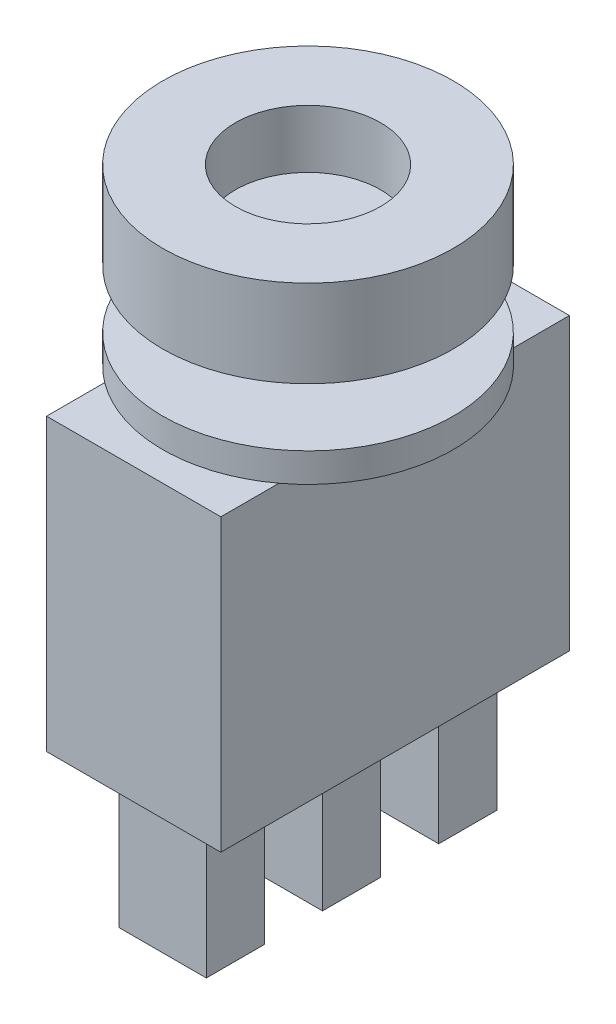
ISO-10303-21;
HEADER;
FILE_DESCRIPTION(('STEP AP214'),'2;1');
FILE_NAME('part.step','',(''),(''),'','','');
FILE_SCHEMA(('AUTOMOTIVE_DESIGN { 1 0 10303 214 1 1 1 1 }'));
ENDSEC;
DATA;
#1=APPLICATION_CONTEXT('core data for automotive mechanical design processes');
#2=APPLICATION_PROTOCOL_DEFINITION('international standard','automotive_design',2000,#1);
#3=PRODUCT_CONTEXT('',#1,'mechanical');
#4=PRODUCT('Part','Part','',(#3));
#5=PRODUCT_RELATED_PRODUCT_CATEGORY('part','',(#4));
#6=PRODUCT_DEFINITION_FORMATION('','',#4);
#7=PRODUCT_DEFINITION_CONTEXT('part definition',#1,'design');
#8=PRODUCT_DEFINITION('design','',#6,#7);
#9=PRODUCT_DEFINITION_SHAPE('','',#8);
#10=(LENGTH_UNIT() NAMED_UNIT(*) SI_UNIT(.MILLI.,.METRE.));
#11=(NAMED_UNIT(*) PLANE_ANGLE_UNIT() SI_UNIT($,.RADIAN.));
#12=(NAMED_UNIT(*) SI_UNIT($,.STERADIAN.) SOLID_ANGLE_UNIT());
#13=UNCERTAINTY_MEASURE_WITH_UNIT(LENGTH_MEASURE(1.E-05),#10,'distance_accuracy_value','');
#14=(GEOMETRIC_REPRESENTATION_CONTEXT(3) GLOBAL_UNCERTAINTY_ASSIGNED_CONTEXT((#13)) GLOBAL_UNIT_ASSIGNED_CONTEXT((#10,
#11,#12)) REPRESENTATION_CONTEXT('',''));
#15=CARTESIAN_POINT('',(0.,0.,0.));
#16=DIRECTION('',(0.,0.,1.));
#17=DIRECTION('',(1.,0.,0.));
#18=AXIS2_PLACEMENT_3D('',#15,#16,#17);
#19=CARTESIAN_POINT('',(3.,-13.,-6.));
#20=DIRECTION('',(0.,-1.,0.));
#21=DIRECTION('',(0.,0.,-1.));
#22=AXIS2_PLACEMENT_3D('',#19,#20,#21);
#23=PLANE('',#22);
#24=DIRECTION('',(1.,0.,0.));
#25=VECTOR('',#24,1.);
#26=CARTESIAN_POINT('',(-1.5,-13.,-1.));
#27=LINE('',#26,#25);
#28=CARTESIAN_POINT('',(-1.5,-13.,-1.));
#29=VERTEX_POINT('',#28);
#30=CARTESIAN_POINT('',(1.5,-13.,-1.));
#31=VERTEX_POINT('',#30);
#32=EDGE_CURVE('E188',#29,#31,#27,.T.);
#33=ORIENTED_EDGE('',*,*,#32,.F.);
#34=DIRECTION('',(0.,0.,-1.));
#35=VECTOR('',#34,1.);
#36=CARTESIAN_POINT('',(-1.5,-13.,-1.));
#37=LINE('',#36,#35);
#38=CARTESIAN_POINT('',(-1.5,-13.,1.));
#39=VERTEX_POINT('',#38);
#40=EDGE_CURVE('E185',#39,#29,#37,.T.);
#41=ORIENTED_EDGE('',*,*,#40,.F.);
#42=DIRECTION('',(-1.,0.,0.));
#43=VECTOR('',#42,1.);
#44=CARTESIAN_POINT('',(-1.5,-13.,1.));
#45=LINE('',#44,#43);
#46=CARTESIAN_POINT('',(1.5,-13.,1.));
#47=VERTEX_POINT('',#46);
#48=EDGE_CURVE('E197',#47,#39,#45,.T.);
#49=ORIENTED_EDGE('',*,*,#48,.F.);
#50=DIRECTION('',(0.,0.,1.));
#51=VECTOR('',#50,1.);
#52=CARTESIAN_POINT('',(1.5,-13.,-1.));
#53=LINE('',#52,#51);
#54=EDGE_CURVE('E205',#31,#47,#53,.T.);
#55=ORIENTED_EDGE('',*,*,#54,.F.);
#56=EDGE_LOOP('',(#33,#41,#49,#55));
#57=FACE_BOUND('',#56,.T.);
#58=DIRECTION('',(0.,0.,1.));
#59=VECTOR('',#58,1.);
#60=CARTESIAN_POINT('',(3.,-13.,-6.));
#61=LINE('',#60,#59);
#62=CARTESIAN_POINT('',(3.,-13.,-6.));
#63=VERTEX_POINT('',#62);
#64=CARTESIAN_POINT('',(3.,-13.,6.));
#65=VERTEX_POINT('',#64);
#66=EDGE_CURVE('E245',#63,#65,#61,.T.);
#67=ORIENTED_EDGE('',*,*,#66,.T.);
#68=DIRECTION('',(-1.,0.,0.));
#69=VECTOR('',#68,1.);
#70=CARTESIAN_POINT('',(3.,-13.,6.));
#71=LINE('',#70,#69);
#72=CARTESIAN_POINT('',(-3.,-13.,6.));
#73=VERTEX_POINT('',#72);
#74=EDGE_CURVE('E248',#65,#73,#71,.T.);
#75=ORIENTED_EDGE('',*,*,#74,.T.);
#76=DIRECTION('',(0.,0.,-1.));
#77=VECTOR('',#76,1.);
#78=CARTESIAN_POINT('',(-3.,-13.,-6.));
#79=LINE('',#78,#77);
#80=CARTESIAN_POINT('',(-3.,-13.,-6.));
#81=VERTEX_POINT('',#80);
#82=EDGE_CURVE('E251',#73,#81,#79,.T.);
#83=ORIENTED_EDGE('',*,*,#82,.T.);
#84=DIRECTION('',(1.,0.,0.));
#85=VECTOR('',#84,1.);
#86=CARTESIAN_POINT('',(3.,-13.,-6.));
#87=LINE('',#86,#85);
#88=EDGE_CURVE('E253',#81,#63,#87,.T.);
#89=ORIENTED_EDGE('',*,*,#88,.T.);
#90=EDGE_LOOP('',(#67,#75,#83,#89));
#91=FACE_BOUND('',#90,.T.);
#92=DIRECTION('',(1.,0.,0.));
#93=VECTOR('',#92,1.);
#94=CARTESIAN_POINT('',(-1.5,-13.,3.));
#95=LINE('',#94,#93);
#96=CARTESIAN_POINT('',(-1.5,-13.,3.));
#97=VERTEX_POINT('',#96);
#98=CARTESIAN_POINT('',(1.5,-13.,3.));
#99=VERTEX_POINT('',#98);
#100=EDGE_CURVE('E230',#97,#99,#95,.T.);
#101=ORIENTED_EDGE('',*,*,#100,.F.);
#102=DIRECTION('',(0.,0.,-1.));
#103=VECTOR('',#102,1.);
#104=CARTESIAN_POINT('',(-1.5,-13.,3.));
#105=LINE('',#104,#103);
#106=CARTESIAN_POINT('',(-1.5,-13.,5.));
#107=VERTEX_POINT('',#106);
#108=EDGE_CURVE('E216',#107,#97,#105,.T.);
#109=ORIENTED_EDGE('',*,*,#108,.F.);
#110=DIRECTION('',(-1.,0.,0.));
#111=VECTOR('',#110,1.);
#112=CARTESIAN_POINT('',(-1.5,-13.,5.));
#113=LINE('',#112,#111);
#114=CARTESIAN_POINT('',(1.5,-13.,5.));
#115=VERTEX_POINT('',#114);
#116=EDGE_CURVE('E221',#115,#107,#113,.T.);
#117=ORIENTED_EDGE('',*,*,#116,.F.);
#118=DIRECTION('',(0.,0.,1.));
#119=VECTOR('',#118,1.);
#120=CARTESIAN_POINT('',(1.5,-13.,3.));
#121=LINE('',#120,#119);
#122=EDGE_CURVE('E232',#99,#115,#121,.T.);
#123=ORIENTED_EDGE('',*,*,#122,.F.);
#124=EDGE_LOOP('',(#101,#109,#117,#123));
#125=FACE_BOUND('',#124,.T.);
#126=DIRECTION('',(1.,0.,0.));
#127=VECTOR('',#126,1.);
#128=CARTESIAN_POINT('',(-1.5,-13.,-5.));
#129=LINE('',#128,#127);
#130=CARTESIAN_POINT('',(-1.5,-13.,-5.));
#131=VERTEX_POINT('',#130);
#132=CARTESIAN_POINT('',(1.5,-13.,-5.));
#133=VERTEX_POINT('',#132);
#134=EDGE_CURVE('E387',#131,#133,#129,.T.);
#135=ORIENTED_EDGE('',*,*,#134,.F.);
#136=DIRECTION('',(0.,0.,-1.));
#137=VECTOR('',#136,1.);
#138=CARTESIAN_POINT('',(-1.5,-13.,-5.));
#139=LINE('',#138,#137);
#140=CARTESIAN_POINT('',(-1.5,-13.,-3.));
#141=VERTEX_POINT('',#140);
#142=EDGE_CURVE('E183',#141,#131,#139,.T.);
#143=ORIENTED_EDGE('',*,*,#142,.F.);
#144=DIRECTION('',(-1.,0.,0.));
#145=VECTOR('',#144,1.);
#146=CARTESIAN_POINT('',(-1.5,-13.,-3.));
#147=LINE('',#146,#145);
#148=CARTESIAN_POINT('',(1.5,-13.,-3.));
#149=VERTEX_POINT('',#148);
#150=EDGE_CURVE('E179',#149,#141,#147,.T.);
#151=ORIENTED_EDGE('',*,*,#150,.F.);
#152=DIRECTION('',(0.,0.,1.));
#153=VECTOR('',#152,1.);
#154=CARTESIAN_POINT('',(1.5,-13.,-5.));
#155=LINE('',#154,#153);
#156=EDGE_CURVE('E389',#133,#149,#155,.T.);
#157=ORIENTED_EDGE('',*,*,#156,.F.);
#158=EDGE_LOOP('',(#135,#143,#151,#157));
#159=FACE_BOUND('',#158,.T.);
#160=ADVANCED_FACE('F30',(#57,#91,#125,#159),#23,.T.);
#161=CARTESIAN_POINT('',(0.,-3.,0.));
#162=DIRECTION('',(0.,-1.,0.));
#163=DIRECTION('',(0.,0.,-1.));
#164=AXIS2_PLACEMENT_3D('',#161,#162,#163);
#165=PLANE('',#164);
#166=DIRECTION('',(0.,0.,1.));
#167=VECTOR('',#166,1.);
#168=CARTESIAN_POINT('',(3.,-3.,-6.));
#169=LINE('',#168,#167);
#170=CARTESIAN_POINT('',(3.,-3.,-4.));
#171=VERTEX_POINT('',#170);
#172=CARTESIAN_POINT('',(3.,-3.,4.));
#173=VERTEX_POINT('',#172);
#174=EDGE_CURVE('E11',#171,#173,#169,.T.);
#175=ORIENTED_EDGE('',*,*,#174,.F.);
#176=CARTESIAN_POINT('',(0.,-3.,0.));
#177=DIRECTION('',(0.,-1.,0.));
#178=DIRECTION('',(0.,0.,-1.));
#179=AXIS2_PLACEMENT_3D('',#176,#177,#178);
#180=CIRCLE('',#179,5.);
#181=EDGE_CURVE('E276',#171,#173,#180,.T.);
#182=ORIENTED_EDGE('',*,*,#181,.T.);
#183=EDGE_LOOP('',(#175,#182));
#184=FACE_BOUND('',#183,.T.);
#185=ADVANCED_FACE('F296',(#184),#165,.T.);
#186=CARTESIAN_POINT('',(0.,0.,0.));
#187=DIRECTION('',(0.,1.,0.));
#188=DIRECTION('',(0.,0.,1.));
#189=AXIS2_PLACEMENT_3D('',#186,#187,#188);
#190=PLANE('',#189);
#191=CARTESIAN_POINT('',(0.,0.,0.));
#192=DIRECTION('',(0.,1.,0.));
#193=DIRECTION('',(0.,0.,1.));
#194=AXIS2_PLACEMENT_3D('',#191,#192,#193);
#195=CIRCLE('',#194,5.);
#196=CARTESIAN_POINT('',(0.,0.,5.));
#197=VERTEX_POINT('',#196);
#198=EDGE_CURVE('E286',#197,#197,#195,.T.);
#199=ORIENTED_EDGE('',*,*,#198,.F.);
#200=EDGE_LOOP('',(#199));
#201=FACE_BOUND('',#200,.T.);
#202=CARTESIAN_POINT('',(0.,0.,0.));
#203=DIRECTION('',(0.,1.,0.));
#204=DIRECTION('',(0.,0.,1.));
#205=AXIS2_PLACEMENT_3D('',#202,#203,#204);
#206=CIRCLE('',#205,2.);
#207=CARTESIAN_POINT('',(0.,0.,2.));
#208=VERTEX_POINT('',#207);
#209=EDGE_CURVE('E34',#208,#208,#206,.F.);
#210=ORIENTED_EDGE('',*,*,#209,.F.);
#211=EDGE_LOOP('',(#210));
#212=FACE_BOUND('',#211,.T.);
#213=ADVANCED_FACE('F293',(#201,#212),#190,.F.);
#214=CARTESIAN_POINT('',(0.,3.,0.));
#215=DIRECTION('',(0.,-1.,0.));
#216=DIRECTION('',(0.,0.,-1.));
#217=AXIS2_PLACEMENT_3D('',#214,#215,#216);
#218=CYLINDRICAL_SURFACE('',#217,5.);
#219=CARTESIAN_POINT('',(0.,3.,0.));
#220=DIRECTION('',(0.,1.,0.));
#221=DIRECTION('',(0.,0.,1.));
#222=AXIS2_PLACEMENT_3D('',#219,#220,#221);
#223=CIRCLE('',#222,5.);
#224=CARTESIAN_POINT('',(0.,3.,5.));
#225=VERTEX_POINT('',#224);
#226=EDGE_CURVE('E287',#225,#225,#223,.T.);
#227=ORIENTED_EDGE('',*,*,#226,.F.);
#228=EDGE_LOOP('',(#227));
#229=FACE_BOUND('',#228,.T.);
#230=ORIENTED_EDGE('',*,*,#198,.T.);
#231=EDGE_LOOP('',(#230));
#232=FACE_BOUND('',#231,.T.);
#233=ADVANCED_FACE('F32',(#229,#232),#218,.T.);
#234=CARTESIAN_POINT('',(0.,3.,0.));
#235=DIRECTION('',(0.,1.,0.));
#236=DIRECTION('',(0.,0.,1.));
#237=AXIS2_PLACEMENT_3D('',#234,#235,#236);
#238=PLANE('',#237);
#239=CARTESIAN_POINT('',(0.,3.,0.));
#240=DIRECTION('',(0.,1.,0.));
#241=DIRECTION('',(0.,0.,1.));
#242=AXIS2_PLACEMENT_3D('',#239,#240,#241);
#243=CIRCLE('',#242,2.5);
#244=CARTESIAN_POINT('',(0.,3.,2.5));
#245=VERTEX_POINT('',#244);
#246=EDGE_CURVE('E375',#245,#245,#243,.T.);
#247=ORIENTED_EDGE('',*,*,#246,.F.);
#248=EDGE_LOOP('',(#247));
#249=FACE_BOUND('',#248,.T.);
#250=ORIENTED_EDGE('',*,*,#226,.T.);
#251=EDGE_LOOP('',(#250));
#252=FACE_BOUND('',#251,.T.);
#253=ADVANCED_FACE('F364',(#249,#252),#238,.T.);
#254=CARTESIAN_POINT('',(0.,-2.,0.));
#255=DIRECTION('',(0.,1.,0.));
#256=DIRECTION('',(0.,0.,1.));
#257=AXIS2_PLACEMENT_3D('',#254,#255,#256);
#258=CYLINDRICAL_SURFACE('',#257,2.);
#259=CARTESIAN_POINT('',(0.,-2.,0.));
#260=DIRECTION('',(0.,-1.,0.));
#261=DIRECTION('',(0.,0.,-1.));
#262=AXIS2_PLACEMENT_3D('',#259,#260,#261);
#263=CIRCLE('',#262,2.);
#264=CARTESIAN_POINT('',(0.,-2.,-2.));
#265=VERTEX_POINT('',#264);
#266=EDGE_CURVE('E279',#265,#265,#263,.T.);
#267=ORIENTED_EDGE('',*,*,#266,.F.);
#268=EDGE_LOOP('',(#267));
#269=FACE_BOUND('',#268,.T.);
#270=ORIENTED_EDGE('',*,*,#209,.T.);
#271=EDGE_LOOP('',(#270));
#272=FACE_BOUND('',#271,.T.);
#273=ADVANCED_FACE('F359',(#269,#272),#258,.T.);
#274=CARTESIAN_POINT('',(0.,-2.,0.));
#275=DIRECTION('',(0.,-1.,0.));
#276=DIRECTION('',(0.,0.,-1.));
#277=AXIS2_PLACEMENT_3D('',#274,#275,#276);
#278=PLANE('',#277);
#279=CARTESIAN_POINT('',(0.,-2.,0.));
#280=DIRECTION('',(0.,-1.,0.));
#281=DIRECTION('',(0.,0.,-1.));
#282=AXIS2_PLACEMENT_3D('',#279,#280,#281);
#283=CIRCLE('',#282,5.);
#284=CARTESIAN_POINT('',(0.,-2.,-5.));
#285=VERTEX_POINT('',#284);
#286=EDGE_CURVE('E275',#285,#285,#283,.T.);
#287=ORIENTED_EDGE('',*,*,#286,.F.);
#288=EDGE_LOOP('',(#287));
#289=FACE_BOUND('',#288,.T.);
#290=ORIENTED_EDGE('',*,*,#266,.T.);
#291=EDGE_LOOP('',(#290));
#292=FACE_BOUND('',#291,.T.);
#293=ADVANCED_FACE('F354',(#289,#292),#278,.F.);
#294=CARTESIAN_POINT('',(0.,-3.,0.));
#295=DIRECTION('',(0.,1.,0.));
#296=DIRECTION('',(0.,0.,1.));
#297=AXIS2_PLACEMENT_3D('',#294,#295,#296);
#298=CYLINDRICAL_SURFACE('',#297,5.);
#299=ORIENTED_EDGE('',*,*,#181,.F.);
#300=CARTESIAN_POINT('',(-3.,-3.,-4.));
#301=VERTEX_POINT('',#300);
#302=EDGE_CURVE('E281',#301,#171,#180,.T.);
#303=ORIENTED_EDGE('',*,*,#302,.F.);
#304=CARTESIAN_POINT('',(-3.,-3.,4.));
#305=VERTEX_POINT('',#304);
#306=EDGE_CURVE('E333',#305,#301,#180,.T.);
#307=ORIENTED_EDGE('',*,*,#306,.F.);
#308=EDGE_CURVE('E280',#173,#305,#180,.T.);
#309=ORIENTED_EDGE('',*,*,#308,.F.);
#310=EDGE_LOOP('',(#299,#303,#307,#309));
#311=FACE_BOUND('',#310,.T.);
#312=ORIENTED_EDGE('',*,*,#286,.T.);
#313=EDGE_LOOP('',(#312));
#314=FACE_BOUND('',#313,.T.);
#315=ADVANCED_FACE('F336',(#311,#314),#298,.T.);
#316=DIRECTION('',(0.,0.,-1.));
#317=VECTOR('',#316,1.);
#318=CARTESIAN_POINT('',(-3.,-3.,-6.));
#319=LINE('',#318,#317);
#320=EDGE_CURVE('E39',#305,#301,#319,.T.);
#321=ORIENTED_EDGE('',*,*,#320,.F.);
#322=ORIENTED_EDGE('',*,*,#306,.T.);
#323=EDGE_LOOP('',(#321,#322));
#324=FACE_BOUND('',#323,.T.);
#325=ADVANCED_FACE('F335',(#324),#165,.T.);
#326=CARTESIAN_POINT('',(3.,-3.,-6.));
#327=DIRECTION('',(0.,-1.,0.));
#328=DIRECTION('',(0.,0.,-1.));
#329=AXIS2_PLACEMENT_3D('',#326,#327,#328);
#330=PLANE('',#329);
#331=CARTESIAN_POINT('',(3.,-3.,6.));
#332=VERTEX_POINT('',#331);
#333=EDGE_CURVE('E42',#173,#332,#169,.T.);
#334=ORIENTED_EDGE('',*,*,#333,.F.);
#335=ORIENTED_EDGE('',*,*,#308,.T.);
#336=CARTESIAN_POINT('',(-3.,-3.,6.));
#337=VERTEX_POINT('',#336);
#338=EDGE_CURVE('E260',#337,#305,#319,.T.);
#339=ORIENTED_EDGE('',*,*,#338,.F.);
#340=DIRECTION('',(-1.,0.,0.));
#341=VECTOR('',#340,1.);
#342=CARTESIAN_POINT('',(3.,-3.,6.));
#343=LINE('',#342,#341);
#344=EDGE_CURVE('E257',#332,#337,#343,.T.);
#345=ORIENTED_EDGE('',*,*,#344,.F.);
#346=EDGE_LOOP('',(#334,#335,#339,#345));
#347=FACE_BOUND('',#346,.T.);
#348=ADVANCED_FACE('F329',(#347),#330,.F.);
#349=CARTESIAN_POINT('',(-3.,-3.,-6.));
#350=VERTEX_POINT('',#349);
#351=EDGE_CURVE('E259',#301,#350,#319,.T.);
#352=ORIENTED_EDGE('',*,*,#351,.F.);
#353=ORIENTED_EDGE('',*,*,#302,.T.);
#354=CARTESIAN_POINT('',(3.,-3.,-6.));
#355=VERTEX_POINT('',#354);
#356=EDGE_CURVE('E41',#355,#171,#169,.T.);
#357=ORIENTED_EDGE('',*,*,#356,.F.);
#358=DIRECTION('',(1.,0.,0.));
#359=VECTOR('',#358,1.);
#360=CARTESIAN_POINT('',(3.,-3.,-6.));
#361=LINE('',#360,#359);
#362=EDGE_CURVE('E249',#350,#355,#361,.T.);
#363=ORIENTED_EDGE('',*,*,#362,.F.);
#364=EDGE_LOOP('',(#352,#353,#357,#363));
#365=FACE_BOUND('',#364,.T.);
#366=ADVANCED_FACE('F314',(#365),#330,.F.);
#367=CARTESIAN_POINT('',(3.,-13.,-6.));
#368=DIRECTION('',(-1.,0.,0.));
#369=DIRECTION('',(0.,0.,1.));
#370=AXIS2_PLACEMENT_3D('',#367,#368,#369);
#371=PLANE('',#370);
#372=ORIENTED_EDGE('',*,*,#356,.T.);
#373=ORIENTED_EDGE('',*,*,#174,.T.);
#374=ORIENTED_EDGE('',*,*,#333,.T.);
#375=DIRECTION('',(0.,1.,0.));
#376=VECTOR('',#375,1.);
#377=CARTESIAN_POINT('',(3.,-13.,6.));
#378=LINE('',#377,#376);
#379=EDGE_CURVE('E272',#65,#332,#378,.T.);
#380=ORIENTED_EDGE('',*,*,#379,.F.);
#381=ORIENTED_EDGE('',*,*,#66,.F.);
#382=DIRECTION('',(0.,1.,0.));
#383=VECTOR('',#382,1.);
#384=CARTESIAN_POINT('',(3.,-13.,-6.));
#385=LINE('',#384,#383);
#386=EDGE_CURVE('E254',#63,#355,#385,.T.);
#387=ORIENTED_EDGE('',*,*,#386,.T.);
#388=EDGE_LOOP('',(#372,#373,#374,#380,#381,#387));
#389=FACE_BOUND('',#388,.T.);
#390=ADVANCED_FACE('F317',(#389),#371,.F.);
#391=CARTESIAN_POINT('',(3.,-13.,6.));
#392=DIRECTION('',(0.,0.,-1.));
#393=DIRECTION('',(-1.,0.,0.));
#394=AXIS2_PLACEMENT_3D('',#391,#392,#393);
#395=PLANE('',#394);
#396=ORIENTED_EDGE('',*,*,#344,.T.);
#397=DIRECTION('',(0.,1.,0.));
#398=VECTOR('',#397,1.);
#399=CARTESIAN_POINT('',(-3.,-13.,6.));
#400=LINE('',#399,#398);
#401=EDGE_CURVE('E269',#73,#337,#400,.T.);
#402=ORIENTED_EDGE('',*,*,#401,.F.);
#403=ORIENTED_EDGE('',*,*,#74,.F.);
#404=ORIENTED_EDGE('',*,*,#379,.T.);
#405=EDGE_LOOP('',(#396,#402,#403,#404));
#406=FACE_BOUND('',#405,.T.);
#407=ADVANCED_FACE('F456',(#406),#395,.F.);
#408=CARTESIAN_POINT('',(-3.,-13.,-6.));
#409=DIRECTION('',(1.,0.,0.));
#410=DIRECTION('',(0.,0.,-1.));
#411=AXIS2_PLACEMENT_3D('',#408,#409,#410);
#412=PLANE('',#411);
#413=ORIENTED_EDGE('',*,*,#338,.T.);
#414=ORIENTED_EDGE('',*,*,#320,.T.);
#415=ORIENTED_EDGE('',*,*,#351,.T.);
#416=DIRECTION('',(0.,1.,0.));
#417=VECTOR('',#416,1.);
#418=CARTESIAN_POINT('',(-3.,-13.,-6.));
#419=LINE('',#418,#417);
#420=EDGE_CURVE('E266',#81,#350,#419,.T.);
#421=ORIENTED_EDGE('',*,*,#420,.F.);
#422=ORIENTED_EDGE('',*,*,#82,.F.);
#423=ORIENTED_EDGE('',*,*,#401,.T.);
#424=EDGE_LOOP('',(#413,#414,#415,#421,#422,#423));
#425=FACE_BOUND('',#424,.T.);
#426=ADVANCED_FACE('F304',(#425),#412,.F.);
#427=CARTESIAN_POINT('',(3.,-13.,-6.));
#428=DIRECTION('',(0.,0.,1.));
#429=DIRECTION('',(1.,0.,0.));
#430=AXIS2_PLACEMENT_3D('',#427,#428,#429);
#431=PLANE('',#430);
#432=ORIENTED_EDGE('',*,*,#362,.T.);
#433=ORIENTED_EDGE('',*,*,#386,.F.);
#434=ORIENTED_EDGE('',*,*,#88,.F.);
#435=ORIENTED_EDGE('',*,*,#420,.T.);
#436=EDGE_LOOP('',(#432,#433,#434,#435));
#437=FACE_BOUND('',#436,.T.);
#438=ADVANCED_FACE('F311',(#437),#431,.F.);
#439=CARTESIAN_POINT('',(-1.5,-18.,3.));
#440=DIRECTION('',(1.,0.,0.));
#441=DIRECTION('',(0.,0.,-1.));
#442=AXIS2_PLACEMENT_3D('',#439,#440,#441);
#443=PLANE('',#442);
#444=ORIENTED_EDGE('',*,*,#108,.T.);
#445=DIRECTION('',(0.,1.,0.));
#446=VECTOR('',#445,1.);
#447=CARTESIAN_POINT('',(-1.5,-18.,3.));
#448=LINE('',#447,#446);
#449=CARTESIAN_POINT('',(-1.5,-18.,3.));
#450=VERTEX_POINT('',#449);
#451=EDGE_CURVE('E243',#450,#97,#448,.T.);
#452=ORIENTED_EDGE('',*,*,#451,.F.);
#453=DIRECTION('',(0.,0.,-1.));
#454=VECTOR('',#453,1.);
#455=CARTESIAN_POINT('',(-1.5,-18.,3.));
#456=LINE('',#455,#454);
#457=CARTESIAN_POINT('',(-1.5,-18.,5.));
#458=VERTEX_POINT('',#457);
#459=EDGE_CURVE('E217',#458,#450,#456,.T.);
#460=ORIENTED_EDGE('',*,*,#459,.F.);
#461=DIRECTION('',(0.,1.,0.));
#462=VECTOR('',#461,1.);
#463=CARTESIAN_POINT('',(-1.5,-18.,5.));
#464=LINE('',#463,#462);
#465=EDGE_CURVE('E227',#458,#107,#464,.T.);
#466=ORIENTED_EDGE('',*,*,#465,.T.);
#467=EDGE_LOOP('',(#444,#452,#460,#466));
#468=FACE_BOUND('',#467,.T.);
#469=ADVANCED_FACE('F447',(#468),#443,.F.);
#470=CARTESIAN_POINT('',(-1.5,-18.,3.));
#471=DIRECTION('',(0.,0.,1.));
#472=DIRECTION('',(1.,0.,0.));
#473=AXIS2_PLACEMENT_3D('',#470,#471,#472);
#474=PLANE('',#473);
#475=ORIENTED_EDGE('',*,*,#100,.T.);
#476=DIRECTION('',(0.,1.,0.));
#477=VECTOR('',#476,1.);
#478=CARTESIAN_POINT('',(1.5,-18.,3.));
#479=LINE('',#478,#477);
#480=CARTESIAN_POINT('',(1.5,-18.,3.));
#481=VERTEX_POINT('',#480);
#482=EDGE_CURVE('E240',#481,#99,#479,.T.);
#483=ORIENTED_EDGE('',*,*,#482,.F.);
#484=DIRECTION('',(1.,0.,0.));
#485=VECTOR('',#484,1.);
#486=CARTESIAN_POINT('',(-1.5,-18.,3.));
#487=LINE('',#486,#485);
#488=EDGE_CURVE('E220',#450,#481,#487,.T.);
#489=ORIENTED_EDGE('',*,*,#488,.F.);
#490=ORIENTED_EDGE('',*,*,#451,.T.);
#491=EDGE_LOOP('',(#475,#483,#489,#490));
#492=FACE_BOUND('',#491,.T.);
#493=ADVANCED_FACE('F443',(#492),#474,.F.);
#494=CARTESIAN_POINT('',(1.5,-18.,3.));
#495=DIRECTION('',(-1.,0.,0.));
#496=DIRECTION('',(0.,0.,1.));
#497=AXIS2_PLACEMENT_3D('',#494,#495,#496);
#498=PLANE('',#497);
#499=ORIENTED_EDGE('',*,*,#122,.T.);
#500=DIRECTION('',(0.,1.,0.));
#501=VECTOR('',#500,1.);
#502=CARTESIAN_POINT('',(1.5,-18.,5.));
#503=LINE('',#502,#501);
#504=CARTESIAN_POINT('',(1.5,-18.,5.));
#505=VERTEX_POINT('',#504);
#506=EDGE_CURVE('E238',#505,#115,#503,.T.);
#507=ORIENTED_EDGE('',*,*,#506,.F.);
#508=DIRECTION('',(0.,0.,1.));
#509=VECTOR('',#508,1.);
#510=CARTESIAN_POINT('',(1.5,-18.,3.));
#511=LINE('',#510,#509);
#512=EDGE_CURVE('E223',#481,#505,#511,.T.);
#513=ORIENTED_EDGE('',*,*,#512,.F.);
#514=ORIENTED_EDGE('',*,*,#482,.T.);
#515=EDGE_LOOP('',(#499,#507,#513,#514));
#516=FACE_BOUND('',#515,.T.);
#517=ADVANCED_FACE('F439',(#516),#498,.F.);
#518=CARTESIAN_POINT('',(-1.5,-18.,5.));
#519=DIRECTION('',(0.,0.,-1.));
#520=DIRECTION('',(-1.,0.,0.));
#521=AXIS2_PLACEMENT_3D('',#518,#519,#520);
#522=PLANE('',#521);
#523=ORIENTED_EDGE('',*,*,#116,.T.);
#524=ORIENTED_EDGE('',*,*,#465,.F.);
#525=DIRECTION('',(-1.,0.,0.));
#526=VECTOR('',#525,1.);
#527=CARTESIAN_POINT('',(-1.5,-18.,5.));
#528=LINE('',#527,#526);
#529=EDGE_CURVE('E225',#505,#458,#528,.T.);
#530=ORIENTED_EDGE('',*,*,#529,.F.);
#531=ORIENTED_EDGE('',*,*,#506,.T.);
#532=EDGE_LOOP('',(#523,#524,#530,#531));
#533=FACE_BOUND('',#532,.T.);
#534=ADVANCED_FACE('F435',(#533),#522,.F.);
#535=CARTESIAN_POINT('',(-1.5,-18.,5.));
#536=DIRECTION('',(0.,1.,0.));
#537=DIRECTION('',(0.,0.,1.));
#538=AXIS2_PLACEMENT_3D('',#535,#536,#537);
#539=PLANE('',#538);
#540=ORIENTED_EDGE('',*,*,#459,.T.);
#541=ORIENTED_EDGE('',*,*,#488,.T.);
#542=ORIENTED_EDGE('',*,*,#512,.T.);
#543=ORIENTED_EDGE('',*,*,#529,.T.);
#544=EDGE_LOOP('',(#540,#541,#542,#543));
#545=FACE_BOUND('',#544,.T.);
#546=ADVANCED_FACE('F431',(#545),#539,.F.);
#547=CARTESIAN_POINT('',(-1.5,-18.,-1.));
#548=DIRECTION('',(1.,0.,0.));
#549=DIRECTION('',(0.,0.,-1.));
#550=AXIS2_PLACEMENT_3D('',#547,#548,#549);
#551=PLANE('',#550);
#552=ORIENTED_EDGE('',*,*,#40,.T.);
#553=DIRECTION('',(0.,1.,0.));
#554=VECTOR('',#553,1.);
#555=CARTESIAN_POINT('',(-1.5,-18.,-1.));
#556=LINE('',#555,#554);
#557=CARTESIAN_POINT('',(-1.5,-18.,-1.));
#558=VERTEX_POINT('',#557);
#559=EDGE_CURVE('E214',#558,#29,#556,.T.);
#560=ORIENTED_EDGE('',*,*,#559,.F.);
#561=DIRECTION('',(0.,0.,-1.));
#562=VECTOR('',#561,1.);
#563=CARTESIAN_POINT('',(-1.5,-18.,-1.));
#564=LINE('',#563,#562);
#565=CARTESIAN_POINT('',(-1.5,-18.,1.));
#566=VERTEX_POINT('',#565);
#567=EDGE_CURVE('E193',#566,#558,#564,.T.);
#568=ORIENTED_EDGE('',*,*,#567,.F.);
#569=DIRECTION('',(0.,1.,0.));
#570=VECTOR('',#569,1.);
#571=CARTESIAN_POINT('',(-1.5,-18.,1.));
#572=LINE('',#571,#570);
#573=EDGE_CURVE('E202',#566,#39,#572,.T.);
#574=ORIENTED_EDGE('',*,*,#573,.T.);
#575=EDGE_LOOP('',(#552,#560,#568,#574));
#576=FACE_BOUND('',#575,.T.);
#577=ADVANCED_FACE('F427',(#576),#551,.F.);
#578=CARTESIAN_POINT('',(-1.5,-18.,-1.));
#579=DIRECTION('',(0.,0.,1.));
#580=DIRECTION('',(1.,0.,0.));
#581=AXIS2_PLACEMENT_3D('',#578,#579,#580);
#582=PLANE('',#581);
#583=ORIENTED_EDGE('',*,*,#32,.T.);
#584=DIRECTION('',(0.,1.,0.));
#585=VECTOR('',#584,1.);
#586=CARTESIAN_POINT('',(1.5,-18.,-1.));
#587=LINE('',#586,#585);
#588=CARTESIAN_POINT('',(1.5,-18.,-1.));
#589=VERTEX_POINT('',#588);
#590=EDGE_CURVE('E211',#589,#31,#587,.T.);
#591=ORIENTED_EDGE('',*,*,#590,.F.);
#592=DIRECTION('',(1.,0.,0.));
#593=VECTOR('',#592,1.);
#594=CARTESIAN_POINT('',(-1.5,-18.,-1.));
#595=LINE('',#594,#593);
#596=EDGE_CURVE('E196',#558,#589,#595,.T.);
#597=ORIENTED_EDGE('',*,*,#596,.F.);
#598=ORIENTED_EDGE('',*,*,#559,.T.);
#599=EDGE_LOOP('',(#583,#591,#597,#598));
#600=FACE_BOUND('',#599,.T.);
#601=ADVANCED_FACE('F423',(#600),#582,.F.);
#602=CARTESIAN_POINT('',(1.5,-18.,-1.));
#603=DIRECTION('',(-1.,0.,0.));
#604=DIRECTION('',(0.,0.,1.));
#605=AXIS2_PLACEMENT_3D('',#602,#603,#604);
#606=PLANE('',#605);
#607=ORIENTED_EDGE('',*,*,#54,.T.);
#608=DIRECTION('',(0.,1.,0.));
#609=VECTOR('',#608,1.);
#610=CARTESIAN_POINT('',(1.5,-18.,1.));
#611=LINE('',#610,#609);
#612=CARTESIAN_POINT('',(1.5,-18.,1.));
#613=VERTEX_POINT('',#612);
#614=EDGE_CURVE('E57',#613,#47,#611,.T.);
#615=ORIENTED_EDGE('',*,*,#614,.F.);
#616=DIRECTION('',(0.,0.,1.));
#617=VECTOR('',#616,1.);
#618=CARTESIAN_POINT('',(1.5,-18.,-1.));
#619=LINE('',#618,#617);
#620=EDGE_CURVE('E199',#589,#613,#619,.T.);
#621=ORIENTED_EDGE('',*,*,#620,.F.);
#622=ORIENTED_EDGE('',*,*,#590,.T.);
#623=EDGE_LOOP('',(#607,#615,#621,#622));
#624=FACE_BOUND('',#623,.T.);
#625=ADVANCED_FACE('F420',(#624),#606,.F.);
#626=CARTESIAN_POINT('',(-1.5,-18.,1.));
#627=DIRECTION('',(0.,0.,-1.));
#628=DIRECTION('',(-1.,0.,0.));
#629=AXIS2_PLACEMENT_3D('',#626,#627,#628);
#630=PLANE('',#629);
#631=ORIENTED_EDGE('',*,*,#48,.T.);
#632=ORIENTED_EDGE('',*,*,#573,.F.);
#633=DIRECTION('',(-1.,0.,0.));
#634=VECTOR('',#633,1.);
#635=CARTESIAN_POINT('',(-1.5,-18.,1.));
#636=LINE('',#635,#634);
#637=EDGE_CURVE('E201',#613,#566,#636,.T.);
#638=ORIENTED_EDGE('',*,*,#637,.F.);
#639=ORIENTED_EDGE('',*,*,#614,.T.);
#640=EDGE_LOOP('',(#631,#632,#638,#639));
#641=FACE_BOUND('',#640,.T.);
#642=ADVANCED_FACE('F416',(#641),#630,.F.);
#643=CARTESIAN_POINT('',(-1.5,-18.,1.));
#644=DIRECTION('',(0.,1.,0.));
#645=DIRECTION('',(0.,0.,1.));
#646=AXIS2_PLACEMENT_3D('',#643,#644,#645);
#647=PLANE('',#646);
#648=ORIENTED_EDGE('',*,*,#567,.T.);
#649=ORIENTED_EDGE('',*,*,#596,.T.);
#650=ORIENTED_EDGE('',*,*,#620,.T.);
#651=ORIENTED_EDGE('',*,*,#637,.T.);
#652=EDGE_LOOP('',(#648,#649,#650,#651));
#653=FACE_BOUND('',#652,.T.);
#654=ADVANCED_FACE('F413',(#653),#647,.F.);
#655=CARTESIAN_POINT('',(-1.5,-18.,-5.));
#656=DIRECTION('',(1.,0.,0.));
#657=DIRECTION('',(0.,0.,-1.));
#658=AXIS2_PLACEMENT_3D('',#655,#656,#657);
#659=PLANE('',#658);
#660=ORIENTED_EDGE('',*,*,#142,.T.);
#661=DIRECTION('',(0.,1.,0.));
#662=VECTOR('',#661,1.);
#663=CARTESIAN_POINT('',(-1.5,-18.,-5.));
#664=LINE('',#663,#662);
#665=CARTESIAN_POINT('',(-1.5,-18.,-5.));
#666=VERTEX_POINT('',#665);
#667=EDGE_CURVE('E164',#666,#131,#664,.T.);
#668=ORIENTED_EDGE('',*,*,#667,.F.);
#669=DIRECTION('',(0.,0.,-1.));
#670=VECTOR('',#669,1.);
#671=CARTESIAN_POINT('',(-1.5,-18.,-5.));
#672=LINE('',#671,#670);
#673=CARTESIAN_POINT('',(-1.5,-18.,-3.));
#674=VERTEX_POINT('',#673);
#675=EDGE_CURVE('E171',#674,#666,#672,.T.);
#676=ORIENTED_EDGE('',*,*,#675,.F.);
#677=DIRECTION('',(0.,1.,0.));
#678=VECTOR('',#677,1.);
#679=CARTESIAN_POINT('',(-1.5,-18.,-3.));
#680=LINE('',#679,#678);
#681=EDGE_CURVE('E385',#674,#141,#680,.T.);
#682=ORIENTED_EDGE('',*,*,#681,.T.);
#683=EDGE_LOOP('',(#660,#668,#676,#682));
#684=FACE_BOUND('',#683,.T.);
#685=ADVANCED_FACE('F181',(#684),#659,.F.);
#686=CARTESIAN_POINT('',(-1.5,-18.,-5.));
#687=DIRECTION('',(0.,0.,1.));
#688=DIRECTION('',(1.,0.,0.));
#689=AXIS2_PLACEMENT_3D('',#686,#687,#688);
#690=PLANE('',#689);
#691=ORIENTED_EDGE('',*,*,#134,.T.);
#692=DIRECTION('',(0.,1.,0.));
#693=VECTOR('',#692,1.);
#694=CARTESIAN_POINT('',(1.5,-18.,-5.));
#695=LINE('',#694,#693);
#696=CARTESIAN_POINT('',(1.5,-18.,-5.));
#697=VERTEX_POINT('',#696);
#698=EDGE_CURVE('E167',#697,#133,#695,.T.);
#699=ORIENTED_EDGE('',*,*,#698,.F.);
#700=DIRECTION('',(1.,0.,0.));
#701=VECTOR('',#700,1.);
#702=CARTESIAN_POINT('',(-1.5,-18.,-5.));
#703=LINE('',#702,#701);
#704=EDGE_CURVE('E160',#666,#697,#703,.T.);
#705=ORIENTED_EDGE('',*,*,#704,.F.);
#706=ORIENTED_EDGE('',*,*,#667,.T.);
#707=EDGE_LOOP('',(#691,#699,#705,#706));
#708=FACE_BOUND('',#707,.T.);
#709=ADVANCED_FACE('F162',(#708),#690,.F.);
#710=CARTESIAN_POINT('',(1.5,-18.,-5.));
#711=DIRECTION('',(-1.,0.,0.));
#712=DIRECTION('',(0.,0.,1.));
#713=AXIS2_PLACEMENT_3D('',#710,#711,#712);
#714=PLANE('',#713);
#715=ORIENTED_EDGE('',*,*,#156,.T.);
#716=DIRECTION('',(0.,1.,0.));
#717=VECTOR('',#716,1.);
#718=CARTESIAN_POINT('',(1.5,-18.,-3.));
#719=LINE('',#718,#717);
#720=CARTESIAN_POINT('',(1.5,-18.,-3.));
#721=VERTEX_POINT('',#720);
#722=EDGE_CURVE('E49',#721,#149,#719,.T.);
#723=ORIENTED_EDGE('',*,*,#722,.F.);
#724=DIRECTION('',(0.,0.,1.));
#725=VECTOR('',#724,1.);
#726=CARTESIAN_POINT('',(1.5,-18.,-5.));
#727=LINE('',#726,#725);
#728=EDGE_CURVE('E170',#697,#721,#727,.T.);
#729=ORIENTED_EDGE('',*,*,#728,.F.);
#730=ORIENTED_EDGE('',*,*,#698,.T.);
#731=EDGE_LOOP('',(#715,#723,#729,#730));
#732=FACE_BOUND('',#731,.T.);
#733=ADVANCED_FACE('F396',(#732),#714,.F.);
#734=CARTESIAN_POINT('',(-1.5,-18.,-3.));
#735=DIRECTION('',(0.,0.,-1.));
#736=DIRECTION('',(-1.,0.,0.));
#737=AXIS2_PLACEMENT_3D('',#734,#735,#736);
#738=PLANE('',#737);
#739=ORIENTED_EDGE('',*,*,#150,.T.);
#740=ORIENTED_EDGE('',*,*,#681,.F.);
#741=DIRECTION('',(-1.,0.,0.));
#742=VECTOR('',#741,1.);
#743=CARTESIAN_POINT('',(-1.5,-18.,-3.));
#744=LINE('',#743,#742);
#745=EDGE_CURVE('E175',#721,#674,#744,.T.);
#746=ORIENTED_EDGE('',*,*,#745,.F.);
#747=ORIENTED_EDGE('',*,*,#722,.T.);
#748=EDGE_LOOP('',(#739,#740,#746,#747));
#749=FACE_BOUND('',#748,.T.);
#750=ADVANCED_FACE('F397',(#749),#738,.F.);
#751=CARTESIAN_POINT('',(-1.5,-18.,-3.));
#752=DIRECTION('',(0.,1.,0.));
#753=DIRECTION('',(0.,0.,1.));
#754=AXIS2_PLACEMENT_3D('',#751,#752,#753);
#755=PLANE('',#754);
#756=ORIENTED_EDGE('',*,*,#675,.T.);
#757=ORIENTED_EDGE('',*,*,#704,.T.);
#758=ORIENTED_EDGE('',*,*,#728,.T.);
#759=ORIENTED_EDGE('',*,*,#745,.T.);
#760=EDGE_LOOP('',(#756,#757,#758,#759));
#761=FACE_BOUND('',#760,.T.);
#762=ADVANCED_FACE('F174',(#761),#755,.F.);
#763=CARTESIAN_POINT('',(0.,1.,0.));
#764=DIRECTION('',(0.,1.,0.));
#765=DIRECTION('',(0.,0.,1.));
#766=AXIS2_PLACEMENT_3D('',#763,#764,#765);
#767=CYLINDRICAL_SURFACE('',#766,2.5);
#768=CARTESIAN_POINT('',(0.,1.,0.));
#769=DIRECTION('',(0.,1.,0.));
#770=DIRECTION('',(0.,0.,1.));
#771=AXIS2_PLACEMENT_3D('',#768,#769,#770);
#772=CIRCLE('',#771,2.5);
#773=CARTESIAN_POINT('',(0.,1.,2.5));
#774=VERTEX_POINT('',#773);
#775=EDGE_CURVE('E378',#774,#774,#772,.T.);
#776=ORIENTED_EDGE('',*,*,#775,.F.);
#777=EDGE_LOOP('',(#776));
#778=FACE_BOUND('',#777,.T.);
#779=ORIENTED_EDGE('',*,*,#246,.T.);
#780=EDGE_LOOP('',(#779));
#781=FACE_BOUND('',#780,.T.);
#782=ADVANCED_FACE('F404',(#778,#781),#767,.F.);
#783=CARTESIAN_POINT('',(0.,1.,0.));
#784=DIRECTION('',(0.,1.,0.));
#785=DIRECTION('',(0.,0.,1.));
#786=AXIS2_PLACEMENT_3D('',#783,#784,#785);
#787=PLANE('',#786);
#788=ORIENTED_EDGE('',*,*,#775,.T.);
#789=EDGE_LOOP('',(#788));
#790=FACE_BOUND('',#789,.T.);
#791=ADVANCED_FACE('F520',(#790),#787,.T.);
#792=CLOSED_SHELL('',(#160,#185,#213,#233,#253,#273,#293,#315,#325,#348,#366,#390,#407,#426,
#438,#469,#493,#517,#534,#546,#577,#601,#625,#642,#654,#685,#709,#733,#750,#762,#782,#791));
#793=MANIFOLD_SOLID_BREP('B2',#792);
#794=ADVANCED_BREP_SHAPE_REPRESENTATION('',(#18,#793),#14);
#795=SHAPE_DEFINITION_REPRESENTATION(#9,#794);
ENDSEC;
END-ISO-10303-21;
